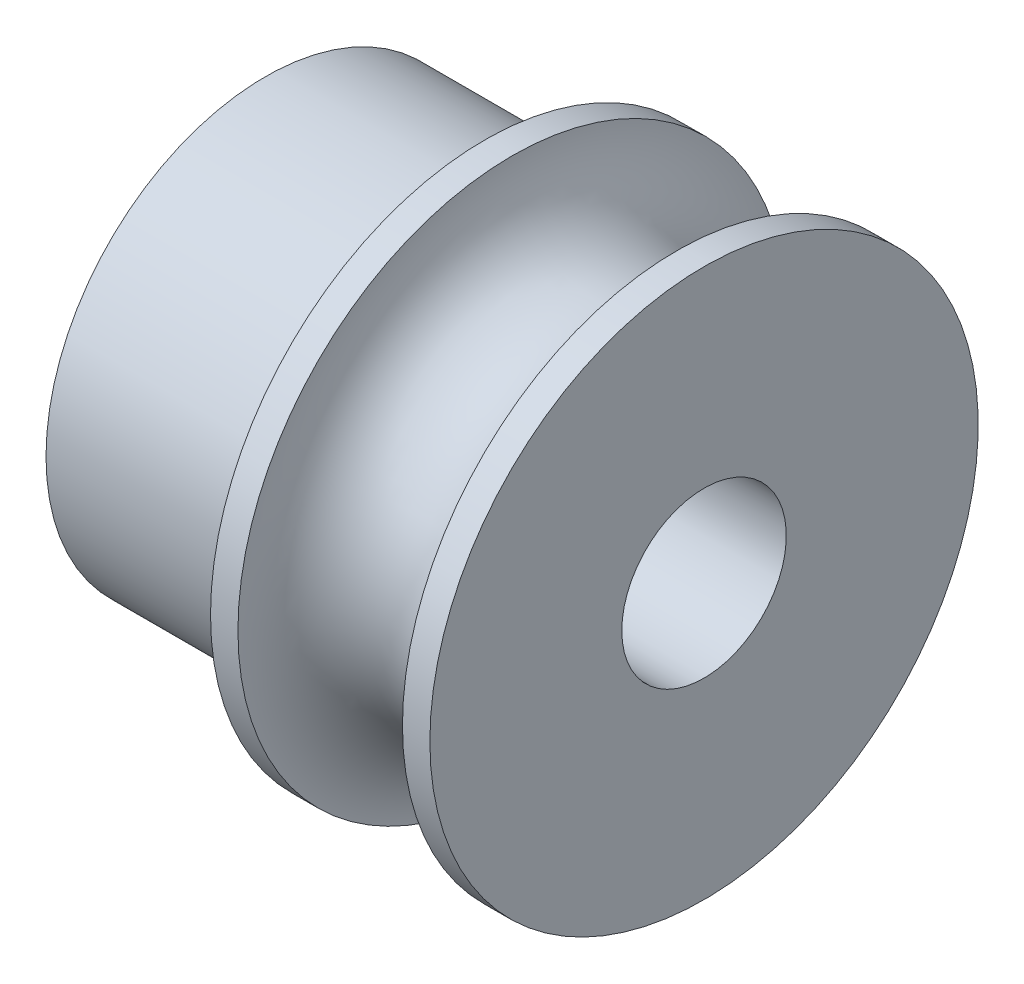
ISO-10303-21;
HEADER;
FILE_DESCRIPTION(('STEP AP214'),'2;1');
FILE_NAME('part.step','',(''),(''),'','','');
FILE_SCHEMA(('AUTOMOTIVE_DESIGN { 1 0 10303 214 1 1 1 1 }'));
ENDSEC;
DATA;
#1=APPLICATION_CONTEXT('core data for automotive mechanical design processes');
#2=APPLICATION_PROTOCOL_DEFINITION('international standard','automotive_design',2000,#1);
#3=PRODUCT_CONTEXT('',#1,'mechanical');
#4=PRODUCT('Part','Part','',(#3));
#5=PRODUCT_RELATED_PRODUCT_CATEGORY('part','',(#4));
#6=PRODUCT_DEFINITION_FORMATION('','',#4);
#7=PRODUCT_DEFINITION_CONTEXT('part definition',#1,'design');
#8=PRODUCT_DEFINITION('design','',#6,#7);
#9=PRODUCT_DEFINITION_SHAPE('','',#8);
#10=(LENGTH_UNIT() NAMED_UNIT(*) SI_UNIT(.MILLI.,.METRE.));
#11=(NAMED_UNIT(*) PLANE_ANGLE_UNIT() SI_UNIT($,.RADIAN.));
#12=(NAMED_UNIT(*) SI_UNIT($,.STERADIAN.) SOLID_ANGLE_UNIT());
#13=UNCERTAINTY_MEASURE_WITH_UNIT(LENGTH_MEASURE(1.E-05),#10,'distance_accuracy_value','');
#14=(GEOMETRIC_REPRESENTATION_CONTEXT(3) GLOBAL_UNCERTAINTY_ASSIGNED_CONTEXT((#13)) GLOBAL_UNIT_ASSIGNED_CONTEXT((#10,
#11,#12)) REPRESENTATION_CONTEXT('',''));
#15=CARTESIAN_POINT('',(0.,0.,0.));
#16=DIRECTION('',(0.,0.,1.));
#17=DIRECTION('',(1.,0.,0.));
#18=AXIS2_PLACEMENT_3D('',#15,#16,#17);
#19=CARTESIAN_POINT('',(362.894917120642,41.3157017452683,-209.806360518351));
#20=DIRECTION('',(-1.,0.,0.));
#21=DIRECTION('',(0.,0.,1.));
#22=AXIS2_PLACEMENT_3D('',#19,#20,#21);
#23=PLANE('',#22);
#24=CARTESIAN_POINT('',(362.894917120642,41.3157017452683,-206.556360518351));
#25=DIRECTION('',(-1.,0.,0.));
#26=DIRECTION('',(0.,0.,1.));
#27=AXIS2_PLACEMENT_3D('',#24,#25,#26);
#28=CIRCLE('',#27,3.99999999999997);
#29=CARTESIAN_POINT('',(362.894917120642,41.3157017452683,-202.556360518351));
#30=VERTEX_POINT('',#29);
#31=EDGE_CURVE('E18',#30,#30,#28,.T.);
#32=ORIENTED_EDGE('',*,*,#31,.F.);
#33=EDGE_LOOP('',(#32));
#34=FACE_BOUND('',#33,.T.);
#35=CARTESIAN_POINT('',(362.894917120642,41.3157017452683,-206.556360518351));
#36=DIRECTION('',(-1.,0.,0.));
#37=DIRECTION('',(0.,0.,1.));
#38=AXIS2_PLACEMENT_3D('',#35,#36,#37);
#39=CIRCLE('',#38,4.99999999999997);
#40=CARTESIAN_POINT('',(362.894917120642,41.3157017452683,-201.556360518351));
#41=VERTEX_POINT('',#40);
#42=EDGE_CURVE('E38',#41,#41,#39,.F.);
#43=ORIENTED_EDGE('',*,*,#42,.F.);
#44=EDGE_LOOP('',(#43));
#45=FACE_BOUND('',#44,.T.);
#46=ADVANCED_FACE('F15',(#34,#45),#23,.T.);
#47=CARTESIAN_POINT('',(362.894917120642,41.3157017452683,-206.556360518351));
#48=DIRECTION('',(-1.,0.,0.));
#49=DIRECTION('',(0.,0.,1.));
#50=AXIS2_PLACEMENT_3D('',#47,#48,#49);
#51=CYLINDRICAL_SURFACE('',#50,3.99999999999997);
#52=ORIENTED_EDGE('',*,*,#31,.T.);
#53=EDGE_LOOP('',(#52));
#54=FACE_BOUND('',#53,.T.);
#55=CARTESIAN_POINT('',(358.894917120642,41.3157017452683,-206.556360518351));
#56=DIRECTION('',(-1.,0.,0.));
#57=DIRECTION('',(0.,0.,1.));
#58=AXIS2_PLACEMENT_3D('',#55,#56,#57);
#59=CIRCLE('',#58,3.99999999999997);
#60=CARTESIAN_POINT('',(358.894917120642,41.3157017452683,-202.556360518351));
#61=VERTEX_POINT('',#60);
#62=EDGE_CURVE('E36',#61,#61,#59,.T.);
#63=ORIENTED_EDGE('',*,*,#62,.F.);
#64=EDGE_LOOP('',(#63));
#65=FACE_BOUND('',#64,.T.);
#66=ADVANCED_FACE('F45',(#54,#65),#51,.T.);
#67=CARTESIAN_POINT('',(363.144917120642,41.3157017452683,-206.556360518351));
#68=DIRECTION('',(-1.,0.,0.));
#69=DIRECTION('',(0.,0.,1.));
#70=AXIS2_PLACEMENT_3D('',#67,#68,#69);
#71=CYLINDRICAL_SURFACE('',#70,4.99999999999997);
#72=ORIENTED_EDGE('',*,*,#42,.T.);
#73=EDGE_LOOP('',(#72));
#74=FACE_BOUND('',#73,.T.);
#75=CARTESIAN_POINT('',(363.394917120642,41.3157017452683,-206.556360518351));
#76=DIRECTION('',(-1.,0.,0.));
#77=DIRECTION('',(0.,0.,-1.));
#78=AXIS2_PLACEMENT_3D('',#75,#76,#77);
#79=CIRCLE('',#78,5.);
#80=CARTESIAN_POINT('',(363.394917120642,41.3157017452683,-211.556360518351));
#81=VERTEX_POINT('',#80);
#82=EDGE_CURVE('E30',#81,#81,#79,.T.);
#83=ORIENTED_EDGE('',*,*,#82,.T.);
#84=EDGE_LOOP('',(#83));
#85=FACE_BOUND('',#84,.T.);
#86=ADVANCED_FACE('F54',(#74,#85),#71,.T.);
#87=CARTESIAN_POINT('',(358.894917120642,43.7251640504797,-208.767412144655));
#88=DIRECTION('',(-1.,0.,0.));
#89=DIRECTION('',(0.,0.,1.));
#90=AXIS2_PLACEMENT_3D('',#87,#88,#89);
#91=PLANE('',#90);
#92=CARTESIAN_POINT('',(358.894917120642,41.3157017452683,-206.556360518351));
#93=DIRECTION('',(-1.,0.,0.));
#94=DIRECTION('',(0.,0.,1.));
#95=AXIS2_PLACEMENT_3D('',#92,#93,#94);
#96=CIRCLE('',#95,1.49999999999997);
#97=CARTESIAN_POINT('',(358.894917120642,41.3157017452683,-205.056360518351));
#98=VERTEX_POINT('',#97);
#99=EDGE_CURVE('E33',#98,#98,#96,.F.);
#100=ORIENTED_EDGE('',*,*,#99,.T.);
#101=EDGE_LOOP('',(#100));
#102=FACE_BOUND('',#101,.T.);
#103=ORIENTED_EDGE('',*,*,#62,.T.);
#104=EDGE_LOOP('',(#103));
#105=FACE_BOUND('',#104,.T.);
#106=ADVANCED_FACE('F74',(#102,#105),#91,.T.);
#107=CARTESIAN_POINT('',(364.894917120642,41.3157017452683,-206.556360518351));
#108=DIRECTION('',(-1.,0.,0.));
#109=DIRECTION('',(0.,0.,-1.));
#110=AXIS2_PLACEMENT_3D('',#107,#108,#109);
#111=TOROIDAL_SURFACE('',#110,4.99999999999998,1.5);
#112=CARTESIAN_POINT('',(366.394917120642,41.3157017452683,-206.556360518351));
#113=DIRECTION('',(-1.,0.,0.));
#114=DIRECTION('',(0.,0.,1.));
#115=AXIS2_PLACEMENT_3D('',#112,#113,#114);
#116=CIRCLE('',#115,4.99999999999997);
#117=CARTESIAN_POINT('',(366.394917120642,41.3157017452683,-201.556360518351));
#118=VERTEX_POINT('',#117);
#119=EDGE_CURVE('E27',#118,#118,#116,.F.);
#120=ORIENTED_EDGE('',*,*,#119,.F.);
#121=EDGE_LOOP('',(#120));
#122=FACE_BOUND('',#121,.T.);
#123=ORIENTED_EDGE('',*,*,#82,.F.);
#124=EDGE_LOOP('',(#123));
#125=FACE_BOUND('',#124,.T.);
#126=ADVANCED_FACE('F69',(#122,#125),#111,.F.);
#127=CARTESIAN_POINT('',(364.894917120642,41.3157017452683,-206.556360518351));
#128=DIRECTION('',(-1.,0.,0.));
#129=DIRECTION('',(0.,0.,1.));
#130=AXIS2_PLACEMENT_3D('',#127,#128,#129);
#131=CYLINDRICAL_SURFACE('',#130,1.49999999999997);
#132=CARTESIAN_POINT('',(366.894917120642,41.3157017452683,-206.556360518351));
#133=DIRECTION('',(-1.,0.,0.));
#134=DIRECTION('',(0.,0.,1.));
#135=AXIS2_PLACEMENT_3D('',#132,#133,#134);
#136=CIRCLE('',#135,1.49999999999997);
#137=CARTESIAN_POINT('',(366.894917120642,41.3157017452683,-205.056360518351));
#138=VERTEX_POINT('',#137);
#139=EDGE_CURVE('E22',#138,#138,#136,.T.);
#140=ORIENTED_EDGE('',*,*,#139,.F.);
#141=EDGE_LOOP('',(#140));
#142=FACE_BOUND('',#141,.T.);
#143=ORIENTED_EDGE('',*,*,#99,.F.);
#144=EDGE_LOOP('',(#143));
#145=FACE_BOUND('',#144,.T.);
#146=ADVANCED_FACE('F62',(#142,#145),#131,.F.);
#147=CARTESIAN_POINT('',(366.644917120642,41.3157017452683,-206.556360518351));
#148=DIRECTION('',(-1.,0.,0.));
#149=DIRECTION('',(0.,0.,1.));
#150=AXIS2_PLACEMENT_3D('',#147,#148,#149);
#151=CYLINDRICAL_SURFACE('',#150,4.99999999999997);
#152=CARTESIAN_POINT('',(366.894917120642,41.3157017452683,-206.556360518351));
#153=DIRECTION('',(-1.,0.,0.));
#154=DIRECTION('',(0.,0.,1.));
#155=AXIS2_PLACEMENT_3D('',#152,#153,#154);
#156=CIRCLE('',#155,4.99999999999997);
#157=CARTESIAN_POINT('',(366.894917120642,41.3157017452683,-201.556360518351));
#158=VERTEX_POINT('',#157);
#159=EDGE_CURVE('E10',#158,#158,#156,.F.);
#160=ORIENTED_EDGE('',*,*,#159,.F.);
#161=EDGE_LOOP('',(#160));
#162=FACE_BOUND('',#161,.T.);
#163=ORIENTED_EDGE('',*,*,#119,.T.);
#164=EDGE_LOOP('',(#163));
#165=FACE_BOUND('',#164,.T.);
#166=ADVANCED_FACE('F57',(#162,#165),#151,.T.);
#167=CARTESIAN_POINT('',(366.894917120642,41.3157017452683,-209.806360518351));
#168=DIRECTION('',(1.,0.,0.));
#169=DIRECTION('',(0.,0.,-1.));
#170=AXIS2_PLACEMENT_3D('',#167,#168,#169);
#171=PLANE('',#170);
#172=ORIENTED_EDGE('',*,*,#159,.T.);
#173=EDGE_LOOP('',(#172));
#174=FACE_BOUND('',#173,.T.);
#175=ORIENTED_EDGE('',*,*,#139,.T.);
#176=EDGE_LOOP('',(#175));
#177=FACE_BOUND('',#176,.T.);
#178=ADVANCED_FACE('F55',(#174,#177),#171,.T.);
#179=CLOSED_SHELL('',(#46,#66,#86,#106,#126,#146,#166,#178));
#180=MANIFOLD_SOLID_BREP('B1',#179);
#181=ADVANCED_BREP_SHAPE_REPRESENTATION('',(#18,#180),#14);
#182=SHAPE_DEFINITION_REPRESENTATION(#9,#181);
ENDSEC;
END-ISO-10303-21;
